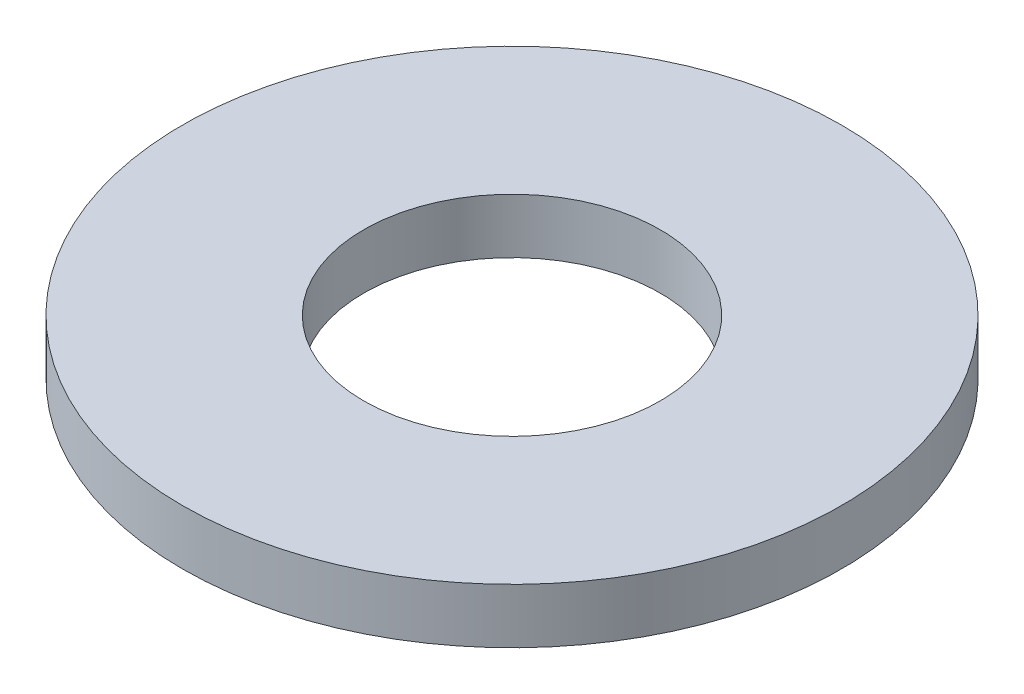
ISO-10303-21;
HEADER;
FILE_DESCRIPTION(('STEP AP214'),'2;1');
FILE_NAME('part.step','',(''),(''),'','','');
FILE_SCHEMA(('AUTOMOTIVE_DESIGN { 1 0 10303 214 1 1 1 1 }'));
ENDSEC;
DATA;
#1=APPLICATION_CONTEXT('core data for automotive mechanical design processes');
#2=APPLICATION_PROTOCOL_DEFINITION('international standard','automotive_design',2000,#1);
#3=PRODUCT_CONTEXT('',#1,'mechanical');
#4=PRODUCT('Part','Part','',(#3));
#5=PRODUCT_RELATED_PRODUCT_CATEGORY('part','',(#4));
#6=PRODUCT_DEFINITION_FORMATION('','',#4);
#7=PRODUCT_DEFINITION_CONTEXT('part definition',#1,'design');
#8=PRODUCT_DEFINITION('design','',#6,#7);
#9=PRODUCT_DEFINITION_SHAPE('','',#8);
#10=(LENGTH_UNIT() NAMED_UNIT(*) SI_UNIT(.MILLI.,.METRE.));
#11=(NAMED_UNIT(*) PLANE_ANGLE_UNIT() SI_UNIT($,.RADIAN.));
#12=(NAMED_UNIT(*) SI_UNIT($,.STERADIAN.) SOLID_ANGLE_UNIT());
#13=UNCERTAINTY_MEASURE_WITH_UNIT(LENGTH_MEASURE(1.E-05),#10,'distance_accuracy_value','');
#14=(GEOMETRIC_REPRESENTATION_CONTEXT(3) GLOBAL_UNCERTAINTY_ASSIGNED_CONTEXT((#13)) GLOBAL_UNIT_ASSIGNED_CONTEXT((#10,
#11,#12)) REPRESENTATION_CONTEXT('',''));
#15=CARTESIAN_POINT('',(0.,0.,0.));
#16=DIRECTION('',(0.,0.,1.));
#17=DIRECTION('',(1.,0.,0.));
#18=AXIS2_PLACEMENT_3D('',#15,#16,#17);
#19=CARTESIAN_POINT('',(0.,1.5,0.));
#20=DIRECTION('',(0.,1.,0.));
#21=DIRECTION('',(0.,0.,1.));
#22=AXIS2_PLACEMENT_3D('',#19,#20,#21);
#23=PLANE('',#22);
#24=CARTESIAN_POINT('',(0.,1.5,0.));
#25=DIRECTION('',(0.,1.,0.));
#26=DIRECTION('',(0.,0.,1.));
#27=AXIS2_PLACEMENT_3D('',#24,#25,#26);
#28=CIRCLE('',#27,9.);
#29=CARTESIAN_POINT('',(0.,1.5,9.));
#30=VERTEX_POINT('',#29);
#31=EDGE_CURVE('E10',#30,#30,#28,.T.);
#32=ORIENTED_EDGE('',*,*,#31,.T.);
#33=EDGE_LOOP('',(#32));
#34=FACE_BOUND('',#33,.T.);
#35=CARTESIAN_POINT('',(0.,1.5,0.));
#36=DIRECTION('',(0.,1.,0.));
#37=DIRECTION('',(0.,0.,1.));
#38=AXIS2_PLACEMENT_3D('',#35,#36,#37);
#39=CIRCLE('',#38,4.05);
#40=CARTESIAN_POINT('',(0.,1.5,4.05));
#41=VERTEX_POINT('',#40);
#42=EDGE_CURVE('E56',#41,#41,#39,.T.);
#43=ORIENTED_EDGE('',*,*,#42,.F.);
#44=EDGE_LOOP('',(#43));
#45=FACE_BOUND('',#44,.T.);
#46=ADVANCED_FACE('F43',(#34,#45),#23,.T.);
#47=CARTESIAN_POINT('',(0.,0.,0.));
#48=DIRECTION('',(0.,1.,0.));
#49=DIRECTION('',(0.,0.,1.));
#50=AXIS2_PLACEMENT_3D('',#47,#48,#49);
#51=PLANE('',#50);
#52=CARTESIAN_POINT('',(0.,0.,0.));
#53=DIRECTION('',(0.,1.,0.));
#54=DIRECTION('',(0.,0.,1.));
#55=AXIS2_PLACEMENT_3D('',#52,#53,#54);
#56=CIRCLE('',#55,9.);
#57=CARTESIAN_POINT('',(0.,0.,9.));
#58=VERTEX_POINT('',#57);
#59=EDGE_CURVE('E47',#58,#58,#56,.T.);
#60=ORIENTED_EDGE('',*,*,#59,.F.);
#61=EDGE_LOOP('',(#60));
#62=FACE_BOUND('',#61,.T.);
#63=CARTESIAN_POINT('',(0.,0.,0.));
#64=DIRECTION('',(0.,1.,0.));
#65=DIRECTION('',(0.,0.,1.));
#66=AXIS2_PLACEMENT_3D('',#63,#64,#65);
#67=CIRCLE('',#66,4.05);
#68=CARTESIAN_POINT('',(0.,0.,4.05));
#69=VERTEX_POINT('',#68);
#70=EDGE_CURVE('E58',#69,#69,#67,.T.);
#71=ORIENTED_EDGE('',*,*,#70,.T.);
#72=EDGE_LOOP('',(#71));
#73=FACE_BOUND('',#72,.T.);
#74=ADVANCED_FACE('F70',(#62,#73),#51,.F.);
#75=CARTESIAN_POINT('',(0.,1.5,0.));
#76=DIRECTION('',(0.,-1.,0.));
#77=DIRECTION('',(0.,0.,-1.));
#78=AXIS2_PLACEMENT_3D('',#75,#76,#77);
#79=CYLINDRICAL_SURFACE('',#78,9.);
#80=ORIENTED_EDGE('',*,*,#31,.F.);
#81=EDGE_LOOP('',(#80));
#82=FACE_BOUND('',#81,.T.);
#83=ORIENTED_EDGE('',*,*,#59,.T.);
#84=EDGE_LOOP('',(#83));
#85=FACE_BOUND('',#84,.T.);
#86=ADVANCED_FACE('F45',(#82,#85),#79,.T.);
#87=CARTESIAN_POINT('',(0.,1.5,0.));
#88=DIRECTION('',(0.,-1.,0.));
#89=DIRECTION('',(0.,0.,-1.));
#90=AXIS2_PLACEMENT_3D('',#87,#88,#89);
#91=CYLINDRICAL_SURFACE('',#90,4.05);
#92=ORIENTED_EDGE('',*,*,#42,.T.);
#93=EDGE_LOOP('',(#92));
#94=FACE_BOUND('',#93,.T.);
#95=ORIENTED_EDGE('',*,*,#70,.F.);
#96=EDGE_LOOP('',(#95));
#97=FACE_BOUND('',#96,.T.);
#98=ADVANCED_FACE('F66',(#94,#97),#91,.F.);
#99=CLOSED_SHELL('',(#46,#74,#86,#98));
#100=MANIFOLD_SOLID_BREP('B2',#99);
#101=ADVANCED_BREP_SHAPE_REPRESENTATION('',(#18,#100),#14);
#102=SHAPE_DEFINITION_REPRESENTATION(#9,#101);
ENDSEC;
END-ISO-10303-21;
